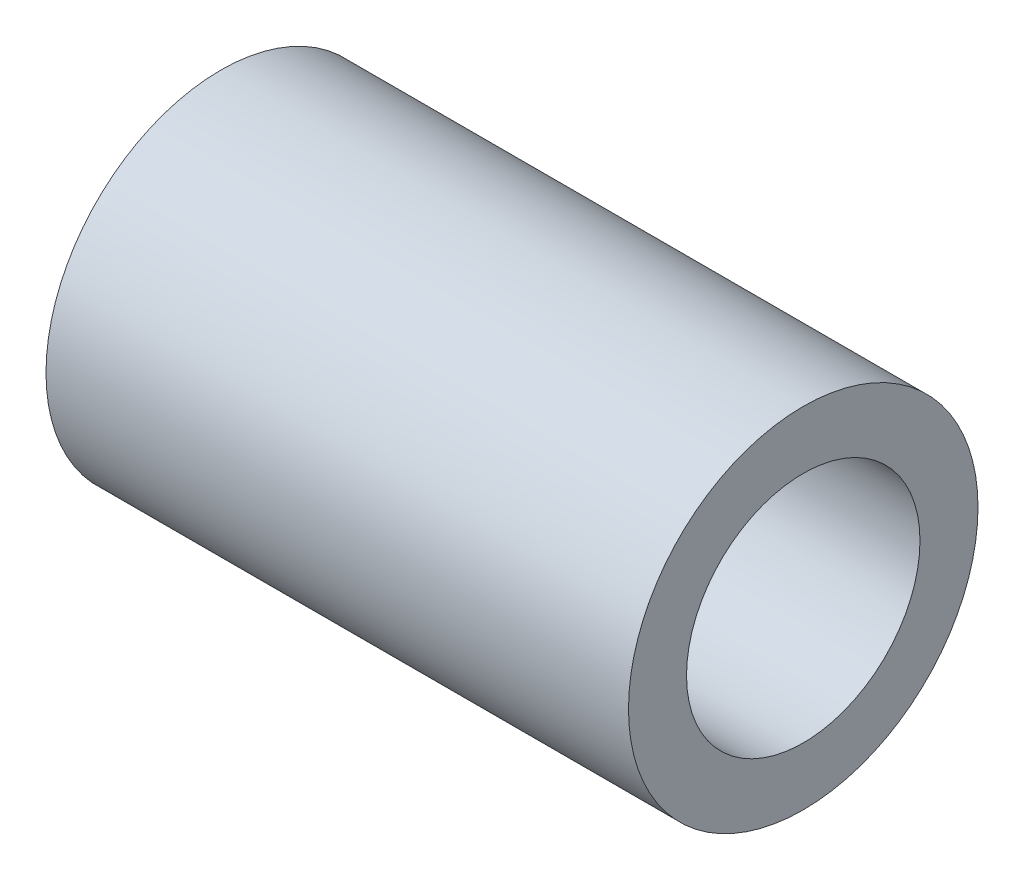
ISO-10303-21;
HEADER;
FILE_DESCRIPTION(('STEP AP214'),'2;1');
FILE_NAME('part.step','',(''),(''),'','','');
FILE_SCHEMA(('AUTOMOTIVE_DESIGN { 1 0 10303 214 1 1 1 1 }'));
ENDSEC;
DATA;
#1=APPLICATION_CONTEXT('core data for automotive mechanical design processes');
#2=APPLICATION_PROTOCOL_DEFINITION('international standard','automotive_design',2000,#1);
#3=PRODUCT_CONTEXT('',#1,'mechanical');
#4=PRODUCT('Part','Part','',(#3));
#5=PRODUCT_RELATED_PRODUCT_CATEGORY('part','',(#4));
#6=PRODUCT_DEFINITION_FORMATION('','',#4);
#7=PRODUCT_DEFINITION_CONTEXT('part definition',#1,'design');
#8=PRODUCT_DEFINITION('design','',#6,#7);
#9=PRODUCT_DEFINITION_SHAPE('','',#8);
#10=(LENGTH_UNIT() NAMED_UNIT(*) SI_UNIT(.MILLI.,.METRE.));
#11=(NAMED_UNIT(*) PLANE_ANGLE_UNIT() SI_UNIT($,.RADIAN.));
#12=(NAMED_UNIT(*) SI_UNIT($,.STERADIAN.) SOLID_ANGLE_UNIT());
#13=UNCERTAINTY_MEASURE_WITH_UNIT(LENGTH_MEASURE(1.E-05),#10,'distance_accuracy_value','');
#14=(GEOMETRIC_REPRESENTATION_CONTEXT(3) GLOBAL_UNCERTAINTY_ASSIGNED_CONTEXT((#13)) GLOBAL_UNIT_ASSIGNED_CONTEXT((#10,
#11,#12)) REPRESENTATION_CONTEXT('',''));
#15=CARTESIAN_POINT('',(0.,0.,0.));
#16=DIRECTION('',(0.,0.,1.));
#17=DIRECTION('',(1.,0.,0.));
#18=AXIS2_PLACEMENT_3D('',#15,#16,#17);
#19=CARTESIAN_POINT('',(0.,9.52500000000003,0.));
#20=DIRECTION('',(1.,0.,0.));
#21=DIRECTION('',(0.,0.,-1.));
#22=AXIS2_PLACEMENT_3D('',#19,#20,#21);
#23=PLANE('',#22);
#24=CARTESIAN_POINT('',(0.,0.,0.));
#25=DIRECTION('',(-1.,0.,0.));
#26=DIRECTION('',(0.,0.,1.));
#27=AXIS2_PLACEMENT_3D('',#24,#25,#26);
#28=CIRCLE('',#27,6.3627);
#29=CARTESIAN_POINT('',(0.,0.,6.36270000000001));
#30=VERTEX_POINT('',#29);
#31=EDGE_CURVE('E10',#30,#30,#28,.T.);
#32=ORIENTED_EDGE('',*,*,#31,.F.);
#33=EDGE_LOOP('',(#32));
#34=FACE_BOUND('',#33,.T.);
#35=CARTESIAN_POINT('',(0.,0.,0.));
#36=DIRECTION('',(-1.,0.,0.));
#37=DIRECTION('',(0.,0.,1.));
#38=AXIS2_PLACEMENT_3D('',#35,#36,#37);
#39=CIRCLE('',#38,9.525);
#40=CARTESIAN_POINT('',(0.,0.,9.52500000000002));
#41=VERTEX_POINT('',#40);
#42=EDGE_CURVE('E36',#41,#41,#39,.T.);
#43=ORIENTED_EDGE('',*,*,#42,.T.);
#44=EDGE_LOOP('',(#43));
#45=FACE_BOUND('',#44,.T.);
#46=ADVANCED_FACE('F22',(#34,#45),#23,.F.);
#47=CARTESIAN_POINT('',(0.,0.,0.));
#48=DIRECTION('',(-1.,0.,0.));
#49=DIRECTION('',(0.,0.,1.));
#50=AXIS2_PLACEMENT_3D('',#47,#48,#49);
#51=CYLINDRICAL_SURFACE('',#50,6.3627);
#52=CARTESIAN_POINT('',(31.75,0.,0.));
#53=DIRECTION('',(-1.,0.,0.));
#54=DIRECTION('',(0.,0.,1.));
#55=AXIS2_PLACEMENT_3D('',#52,#53,#54);
#56=CIRCLE('',#55,6.3627);
#57=CARTESIAN_POINT('',(31.75,0.,6.36270000000001));
#58=VERTEX_POINT('',#57);
#59=EDGE_CURVE('E28',#58,#58,#56,.T.);
#60=ORIENTED_EDGE('',*,*,#59,.F.);
#61=EDGE_LOOP('',(#60));
#62=FACE_BOUND('',#61,.T.);
#63=ORIENTED_EDGE('',*,*,#31,.T.);
#64=EDGE_LOOP('',(#63));
#65=FACE_BOUND('',#64,.T.);
#66=ADVANCED_FACE('F51',(#62,#65),#51,.F.);
#67=CARTESIAN_POINT('',(31.75,9.52500000000003,0.));
#68=DIRECTION('',(-1.,0.,0.));
#69=DIRECTION('',(0.,0.,1.));
#70=AXIS2_PLACEMENT_3D('',#67,#68,#69);
#71=PLANE('',#70);
#72=CARTESIAN_POINT('',(31.75,0.,0.));
#73=DIRECTION('',(-1.,0.,0.));
#74=DIRECTION('',(0.,0.,1.));
#75=AXIS2_PLACEMENT_3D('',#72,#73,#74);
#76=CIRCLE('',#75,9.525);
#77=CARTESIAN_POINT('',(31.75,0.,9.52500000000002));
#78=VERTEX_POINT('',#77);
#79=EDGE_CURVE('E32',#78,#78,#76,.T.);
#80=ORIENTED_EDGE('',*,*,#79,.F.);
#81=EDGE_LOOP('',(#80));
#82=FACE_BOUND('',#81,.T.);
#83=ORIENTED_EDGE('',*,*,#59,.T.);
#84=EDGE_LOOP('',(#83));
#85=FACE_BOUND('',#84,.T.);
#86=ADVANCED_FACE('F46',(#82,#85),#71,.F.);
#87=CARTESIAN_POINT('',(0.,0.,0.));
#88=DIRECTION('',(-1.,0.,0.));
#89=DIRECTION('',(0.,0.,1.));
#90=AXIS2_PLACEMENT_3D('',#87,#88,#89);
#91=CYLINDRICAL_SURFACE('',#90,9.525);
#92=ORIENTED_EDGE('',*,*,#42,.F.);
#93=EDGE_LOOP('',(#92));
#94=FACE_BOUND('',#93,.T.);
#95=ORIENTED_EDGE('',*,*,#79,.T.);
#96=EDGE_LOOP('',(#95));
#97=FACE_BOUND('',#96,.T.);
#98=ADVANCED_FACE('F43',(#94,#97),#91,.T.);
#99=CLOSED_SHELL('',(#46,#66,#86,#98));
#100=MANIFOLD_SOLID_BREP('B2',#99);
#101=ADVANCED_BREP_SHAPE_REPRESENTATION('',(#18,#100),#14);
#102=SHAPE_DEFINITION_REPRESENTATION(#9,#101);
ENDSEC;
END-ISO-10303-21;
